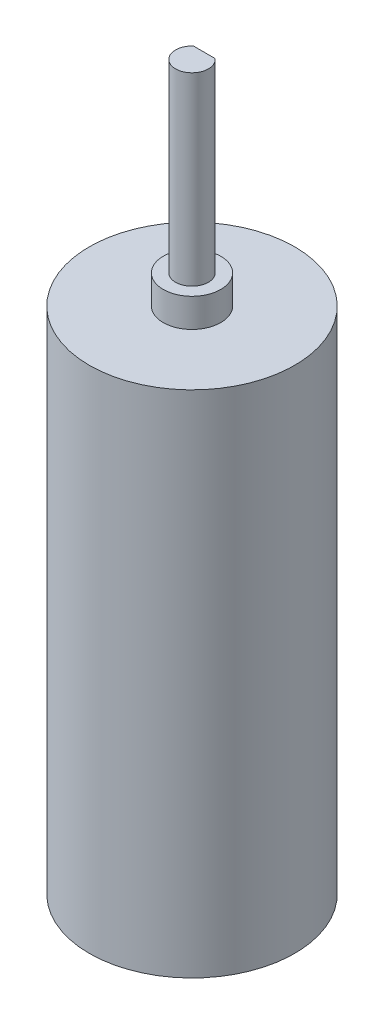
ISO-10303-21;
HEADER;
FILE_DESCRIPTION(('STEP AP214'),'2;1');
FILE_NAME('part.step','',(''),(''),'','','');
FILE_SCHEMA(('AUTOMOTIVE_DESIGN { 1 0 10303 214 1 1 1 1 }'));
ENDSEC;
DATA;
#1=APPLICATION_CONTEXT('core data for automotive mechanical design processes');
#2=APPLICATION_PROTOCOL_DEFINITION('international standard','automotive_design',2000,#1);
#3=PRODUCT_CONTEXT('',#1,'mechanical');
#4=PRODUCT('Part','Part','',(#3));
#5=PRODUCT_RELATED_PRODUCT_CATEGORY('part','',(#4));
#6=PRODUCT_DEFINITION_FORMATION('','',#4);
#7=PRODUCT_DEFINITION_CONTEXT('part definition',#1,'design');
#8=PRODUCT_DEFINITION('design','',#6,#7);
#9=PRODUCT_DEFINITION_SHAPE('','',#8);
#10=(LENGTH_UNIT() NAMED_UNIT(*) SI_UNIT(.MILLI.,.METRE.));
#11=(NAMED_UNIT(*) PLANE_ANGLE_UNIT() SI_UNIT($,.RADIAN.));
#12=(NAMED_UNIT(*) SI_UNIT($,.STERADIAN.) SOLID_ANGLE_UNIT());
#13=UNCERTAINTY_MEASURE_WITH_UNIT(LENGTH_MEASURE(1.E-05),#10,'distance_accuracy_value','');
#14=(GEOMETRIC_REPRESENTATION_CONTEXT(3) GLOBAL_UNCERTAINTY_ASSIGNED_CONTEXT((#13)) GLOBAL_UNIT_ASSIGNED_CONTEXT((#10,
#11,#12)) REPRESENTATION_CONTEXT('',''));
#15=CARTESIAN_POINT('',(0.,0.,0.));
#16=DIRECTION('',(0.,0.,1.));
#17=DIRECTION('',(1.,0.,0.));
#18=AXIS2_PLACEMENT_3D('',#15,#16,#17);
#19=CARTESIAN_POINT('',(0.,62.,0.));
#20=DIRECTION('',(0.,-1.,0.));
#21=DIRECTION('',(0.,0.,-1.));
#22=AXIS2_PLACEMENT_3D('',#19,#20,#21);
#23=CYLINDRICAL_SURFACE('',#22,12.5);
#24=CARTESIAN_POINT('',(0.,62.,0.));
#25=DIRECTION('',(0.,1.,0.));
#26=DIRECTION('',(0.,0.,1.));
#27=AXIS2_PLACEMENT_3D('',#24,#25,#26);
#28=CIRCLE('',#27,12.5);
#29=CARTESIAN_POINT('',(0.,62.,12.5));
#30=VERTEX_POINT('',#29);
#31=EDGE_CURVE('E82',#30,#30,#28,.T.);
#32=ORIENTED_EDGE('',*,*,#31,.F.);
#33=EDGE_LOOP('',(#32));
#34=FACE_BOUND('',#33,.T.);
#35=CARTESIAN_POINT('',(0.,0.,0.));
#36=DIRECTION('',(0.,1.,0.));
#37=DIRECTION('',(0.,0.,1.));
#38=AXIS2_PLACEMENT_3D('',#35,#36,#37);
#39=CIRCLE('',#38,12.5);
#40=CARTESIAN_POINT('',(0.,0.,12.5));
#41=VERTEX_POINT('',#40);
#42=EDGE_CURVE('E37',#41,#41,#39,.T.);
#43=ORIENTED_EDGE('',*,*,#42,.T.);
#44=EDGE_LOOP('',(#43));
#45=FACE_BOUND('',#44,.T.);
#46=ADVANCED_FACE('F34',(#34,#45),#23,.T.);
#47=CARTESIAN_POINT('',(0.,62.,0.));
#48=DIRECTION('',(0.,1.,0.));
#49=DIRECTION('',(0.,0.,1.));
#50=AXIS2_PLACEMENT_3D('',#47,#48,#49);
#51=PLANE('',#50);
#52=CARTESIAN_POINT('',(0.,62.,0.));
#53=DIRECTION('',(0.,1.,0.));
#54=DIRECTION('',(0.,0.,1.));
#55=AXIS2_PLACEMENT_3D('',#52,#53,#54);
#56=CIRCLE('',#55,3.5);
#57=CARTESIAN_POINT('',(0.,62.,3.5));
#58=VERTEX_POINT('',#57);
#59=EDGE_CURVE('E42',#58,#58,#56,.T.);
#60=ORIENTED_EDGE('',*,*,#59,.F.);
#61=EDGE_LOOP('',(#60));
#62=FACE_BOUND('',#61,.T.);
#63=ORIENTED_EDGE('',*,*,#31,.T.);
#64=EDGE_LOOP('',(#63));
#65=FACE_BOUND('',#64,.T.);
#66=ADVANCED_FACE('F93',(#62,#65),#51,.T.);
#67=CARTESIAN_POINT('',(0.,0.,0.));
#68=DIRECTION('',(0.,1.,0.));
#69=DIRECTION('',(0.,0.,1.));
#70=AXIS2_PLACEMENT_3D('',#67,#68,#69);
#71=PLANE('',#70);
#72=ORIENTED_EDGE('',*,*,#42,.F.);
#73=EDGE_LOOP('',(#72));
#74=FACE_BOUND('',#73,.T.);
#75=ADVANCED_FACE('F90',(#74),#71,.F.);
#76=CARTESIAN_POINT('',(0.,65.5,0.));
#77=DIRECTION('',(0.,-1.,0.));
#78=DIRECTION('',(0.,0.,-1.));
#79=AXIS2_PLACEMENT_3D('',#76,#77,#78);
#80=CYLINDRICAL_SURFACE('',#79,3.5);
#81=CARTESIAN_POINT('',(0.,65.5,0.));
#82=DIRECTION('',(0.,1.,0.));
#83=DIRECTION('',(0.,0.,1.));
#84=AXIS2_PLACEMENT_3D('',#81,#82,#83);
#85=CIRCLE('',#84,3.5);
#86=CARTESIAN_POINT('',(0.,65.5,3.5));
#87=VERTEX_POINT('',#86);
#88=EDGE_CURVE('E75',#87,#87,#85,.T.);
#89=ORIENTED_EDGE('',*,*,#88,.F.);
#90=EDGE_LOOP('',(#89));
#91=FACE_BOUND('',#90,.T.);
#92=ORIENTED_EDGE('',*,*,#59,.T.);
#93=EDGE_LOOP('',(#92));
#94=FACE_BOUND('',#93,.T.);
#95=ADVANCED_FACE('F92',(#91,#94),#80,.T.);
#96=CARTESIAN_POINT('',(0.,65.5,0.));
#97=DIRECTION('',(0.,1.,0.));
#98=DIRECTION('',(0.,0.,1.));
#99=AXIS2_PLACEMENT_3D('',#96,#97,#98);
#100=PLANE('',#99);
#101=CARTESIAN_POINT('',(0.,65.5,0.));
#102=DIRECTION('',(0.,1.,0.));
#103=DIRECTION('',(0.,0.,1.));
#104=AXIS2_PLACEMENT_3D('',#101,#102,#103);
#105=CIRCLE('',#104,2.);
#106=CARTESIAN_POINT('',(0.,65.5,2.));
#107=VERTEX_POINT('',#106);
#108=EDGE_CURVE('E11',#107,#107,#105,.T.);
#109=ORIENTED_EDGE('',*,*,#108,.F.);
#110=EDGE_LOOP('',(#109));
#111=FACE_BOUND('',#110,.T.);
#112=ORIENTED_EDGE('',*,*,#88,.T.);
#113=EDGE_LOOP('',(#112));
#114=FACE_BOUND('',#113,.T.);
#115=ADVANCED_FACE('F98',(#111,#114),#100,.T.);
#116=CARTESIAN_POINT('',(0.,88.,0.));
#117=DIRECTION('',(0.,-1.,0.));
#118=DIRECTION('',(0.,0.,-1.));
#119=AXIS2_PLACEMENT_3D('',#116,#117,#118);
#120=CYLINDRICAL_SURFACE('',#119,2.);
#121=CARTESIAN_POINT('',(0.,88.,0.));
#122=DIRECTION('',(0.,1.,0.));
#123=DIRECTION('',(0.,0.,1.));
#124=AXIS2_PLACEMENT_3D('',#121,#122,#123);
#125=CIRCLE('',#124,2.);
#126=CARTESIAN_POINT('',(-1.3228756555323,88.,-1.5));
#127=VERTEX_POINT('',#126);
#128=CARTESIAN_POINT('',(1.3228756555323,88.,-1.5));
#129=VERTEX_POINT('',#128);
#130=EDGE_CURVE('E72',#127,#129,#125,.T.);
#131=ORIENTED_EDGE('',*,*,#130,.F.);
#132=DIRECTION('',(0.,1.,0.));
#133=VECTOR('',#132,1.);
#134=CARTESIAN_POINT('',(-1.3228756555323,69.5,-1.5));
#135=LINE('',#134,#133);
#136=CARTESIAN_POINT('',(-1.3228756555323,69.5,-1.5));
#137=VERTEX_POINT('',#136);
#138=EDGE_CURVE('E50',#137,#127,#135,.T.);
#139=ORIENTED_EDGE('',*,*,#138,.F.);
#140=CARTESIAN_POINT('',(0.,69.5,0.));
#141=DIRECTION('',(0.,1.,0.));
#142=DIRECTION('',(0.,0.,1.));
#143=AXIS2_PLACEMENT_3D('',#140,#141,#142);
#144=CIRCLE('',#143,2.);
#145=CARTESIAN_POINT('',(1.3228756555323,69.5,-1.5));
#146=VERTEX_POINT('',#145);
#147=EDGE_CURVE('E66',#146,#137,#144,.T.);
#148=ORIENTED_EDGE('',*,*,#147,.F.);
#149=DIRECTION('',(0.,1.,0.));
#150=VECTOR('',#149,1.);
#151=CARTESIAN_POINT('',(1.3228756555323,69.5,-1.5));
#152=LINE('',#151,#150);
#153=EDGE_CURVE('E56',#146,#129,#152,.T.);
#154=ORIENTED_EDGE('',*,*,#153,.T.);
#155=EDGE_LOOP('',(#131,#139,#148,#154));
#156=FACE_BOUND('',#155,.T.);
#157=ORIENTED_EDGE('',*,*,#108,.T.);
#158=EDGE_LOOP('',(#157));
#159=FACE_BOUND('',#158,.T.);
#160=ADVANCED_FACE('F70',(#156,#159),#120,.T.);
#161=CARTESIAN_POINT('',(0.,88.,0.));
#162=DIRECTION('',(0.,1.,0.));
#163=DIRECTION('',(0.,0.,1.));
#164=AXIS2_PLACEMENT_3D('',#161,#162,#163);
#165=PLANE('',#164);
#166=DIRECTION('',(1.,0.,0.));
#167=VECTOR('',#166,1.);
#168=CARTESIAN_POINT('',(0.,88.,-1.5));
#169=LINE('',#168,#167);
#170=EDGE_CURVE('E61',#127,#129,#169,.T.);
#171=ORIENTED_EDGE('',*,*,#170,.F.);
#172=ORIENTED_EDGE('',*,*,#130,.T.);
#173=EDGE_LOOP('',(#171,#172));
#174=FACE_BOUND('',#173,.T.);
#175=ADVANCED_FACE('F74',(#174),#165,.T.);
#176=CARTESIAN_POINT('',(0.,69.5,-1.5));
#177=DIRECTION('',(0.,0.,1.));
#178=DIRECTION('',(1.,0.,0.));
#179=AXIS2_PLACEMENT_3D('',#176,#177,#178);
#180=PLANE('',#179);
#181=ORIENTED_EDGE('',*,*,#170,.T.);
#182=ORIENTED_EDGE('',*,*,#153,.F.);
#183=DIRECTION('',(1.,0.,0.));
#184=VECTOR('',#183,1.);
#185=CARTESIAN_POINT('',(0.,69.5,-1.5));
#186=LINE('',#185,#184);
#187=EDGE_CURVE('E166',#137,#146,#186,.T.);
#188=ORIENTED_EDGE('',*,*,#187,.F.);
#189=ORIENTED_EDGE('',*,*,#138,.T.);
#190=EDGE_LOOP('',(#181,#182,#188,#189));
#191=FACE_BOUND('',#190,.T.);
#192=ADVANCED_FACE('F62',(#191),#180,.F.);
#193=CARTESIAN_POINT('',(0.,69.5,0.));
#194=DIRECTION('',(0.,1.,0.));
#195=DIRECTION('',(0.,0.,1.));
#196=AXIS2_PLACEMENT_3D('',#193,#194,#195);
#197=PLANE('',#196);
#198=ORIENTED_EDGE('',*,*,#147,.T.);
#199=ORIENTED_EDGE('',*,*,#187,.T.);
#200=EDGE_LOOP('',(#198,#199));
#201=FACE_BOUND('',#200,.T.);
#202=ADVANCED_FACE('F153',(#201),#197,.T.);
#203=CLOSED_SHELL('',(#46,#66,#75,#95,#115,#160,#175,#192,#202));
#204=MANIFOLD_SOLID_BREP('B2',#203);
#205=ADVANCED_BREP_SHAPE_REPRESENTATION('',(#18,#204),#14);
#206=SHAPE_DEFINITION_REPRESENTATION(#9,#205);
ENDSEC;
END-ISO-10303-21;
